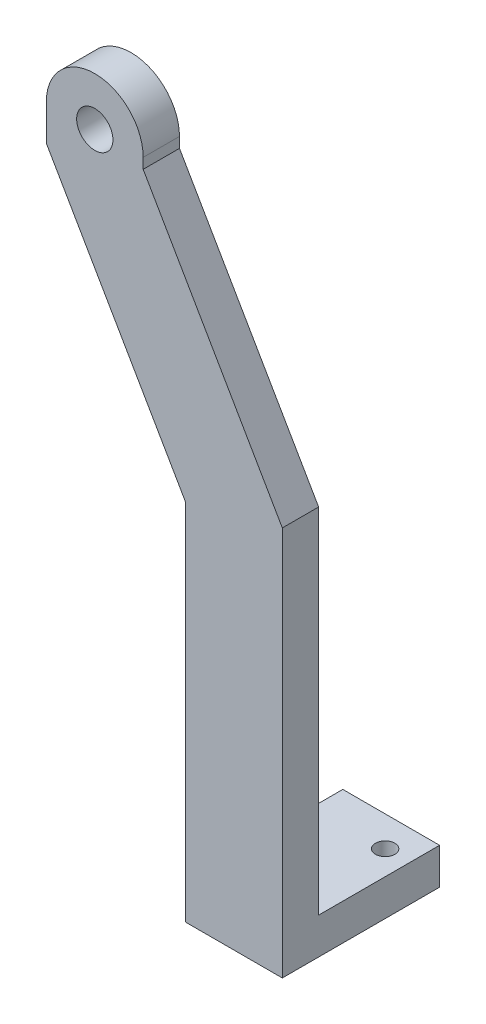
ISO-10303-21;
HEADER;
FILE_DESCRIPTION(('STEP AP214'),'2;1');
FILE_NAME('part.step','',(''),(''),'','','');
FILE_SCHEMA(('AUTOMOTIVE_DESIGN { 1 0 10303 214 1 1 1 1 }'));
ENDSEC;
DATA;
#1=APPLICATION_CONTEXT('core data for automotive mechanical design processes');
#2=APPLICATION_PROTOCOL_DEFINITION('international standard','automotive_design',2000,#1);
#3=PRODUCT_CONTEXT('',#1,'mechanical');
#4=PRODUCT('Part','Part','',(#3));
#5=PRODUCT_RELATED_PRODUCT_CATEGORY('part','',(#4));
#6=PRODUCT_DEFINITION_FORMATION('','',#4);
#7=PRODUCT_DEFINITION_CONTEXT('part definition',#1,'design');
#8=PRODUCT_DEFINITION('design','',#6,#7);
#9=PRODUCT_DEFINITION_SHAPE('','',#8);
#10=(LENGTH_UNIT() NAMED_UNIT(*) SI_UNIT(.MILLI.,.METRE.));
#11=(NAMED_UNIT(*) PLANE_ANGLE_UNIT() SI_UNIT($,.RADIAN.));
#12=(NAMED_UNIT(*) SI_UNIT($,.STERADIAN.) SOLID_ANGLE_UNIT());
#13=UNCERTAINTY_MEASURE_WITH_UNIT(LENGTH_MEASURE(1.E-05),#10,'distance_accuracy_value','');
#14=(GEOMETRIC_REPRESENTATION_CONTEXT(3) GLOBAL_UNCERTAINTY_ASSIGNED_CONTEXT((#13)) GLOBAL_UNIT_ASSIGNED_CONTEXT((#10,
#11,#12)) REPRESENTATION_CONTEXT('',''));
#15=CARTESIAN_POINT('',(0.,0.,0.));
#16=DIRECTION('',(0.,0.,1.));
#17=DIRECTION('',(1.,0.,0.));
#18=AXIS2_PLACEMENT_3D('',#15,#16,#17);
#19=CARTESIAN_POINT('',(34.,-14.,-8.));
#20=DIRECTION('',(0.,1.,0.));
#21=DIRECTION('',(-1.,0.,0.));
#22=AXIS2_PLACEMENT_3D('',#19,#20,#21);
#23=CYLINDRICAL_SURFACE('',#22,1.6);
#24=CARTESIAN_POINT('',(34.,0.,-8.));
#25=DIRECTION('',(0.,1.,0.));
#26=DIRECTION('',(-1.,0.,0.));
#27=AXIS2_PLACEMENT_3D('',#24,#25,#26);
#28=CIRCLE('',#27,1.6);
#29=CARTESIAN_POINT('',(32.4,0.,-8.));
#30=VERTEX_POINT('',#29);
#31=EDGE_CURVE('E154',#30,#30,#28,.F.);
#32=ORIENTED_EDGE('',*,*,#31,.T.);
#33=EDGE_LOOP('',(#32));
#34=FACE_BOUND('',#33,.T.);
#35=CARTESIAN_POINT('',(34.,5.99999999999999,-8.));
#36=DIRECTION('',(0.,1.,0.));
#37=DIRECTION('',(-1.,0.,0.));
#38=AXIS2_PLACEMENT_3D('',#35,#36,#37);
#39=CIRCLE('',#38,1.6);
#40=CARTESIAN_POINT('',(32.4,5.99999999999999,-8.));
#41=VERTEX_POINT('',#40);
#42=EDGE_CURVE('E20',#41,#41,#39,.T.);
#43=ORIENTED_EDGE('',*,*,#42,.T.);
#44=EDGE_LOOP('',(#43));
#45=FACE_BOUND('',#44,.T.);
#46=ADVANCED_FACE('F17',(#34,#45),#23,.F.);
#47=CARTESIAN_POINT('',(42.,-14.,-15.));
#48=DIRECTION('',(0.,1.,0.));
#49=DIRECTION('',(-1.,0.,0.));
#50=AXIS2_PLACEMENT_3D('',#47,#48,#49);
#51=CYLINDRICAL_SURFACE('',#50,1.6);
#52=CARTESIAN_POINT('',(42.,0.,-15.));
#53=DIRECTION('',(0.,1.,0.));
#54=DIRECTION('',(-1.,0.,0.));
#55=AXIS2_PLACEMENT_3D('',#52,#53,#54);
#56=CIRCLE('',#55,1.6);
#57=CARTESIAN_POINT('',(40.4,0.,-15.));
#58=VERTEX_POINT('',#57);
#59=EDGE_CURVE('E150',#58,#58,#56,.F.);
#60=ORIENTED_EDGE('',*,*,#59,.T.);
#61=EDGE_LOOP('',(#60));
#62=FACE_BOUND('',#61,.T.);
#63=CARTESIAN_POINT('',(42.,5.99999999999999,-15.));
#64=DIRECTION('',(0.,1.,0.));
#65=DIRECTION('',(-1.,0.,0.));
#66=AXIS2_PLACEMENT_3D('',#63,#64,#65);
#67=CIRCLE('',#66,1.6);
#68=CARTESIAN_POINT('',(40.4,5.99999999999999,-15.));
#69=VERTEX_POINT('',#68);
#70=EDGE_CURVE('E181',#69,#69,#67,.T.);
#71=ORIENTED_EDGE('',*,*,#70,.T.);
#72=EDGE_LOOP('',(#71));
#73=FACE_BOUND('',#72,.T.);
#74=ADVANCED_FACE('F221',(#62,#73),#51,.F.);
#75=CARTESIAN_POINT('',(46.,6.,-20.));
#76=DIRECTION('',(0.,-1.,0.));
#77=DIRECTION('',(1.,0.,0.));
#78=AXIS2_PLACEMENT_3D('',#75,#76,#77);
#79=PLANE('',#78);
#80=DIRECTION('',(0.,0.,1.));
#81=VECTOR('',#80,1.);
#82=CARTESIAN_POINT('',(46.,6.,6.));
#83=LINE('',#82,#81);
#84=CARTESIAN_POINT('',(46.,6.,0.));
#85=VERTEX_POINT('',#84);
#86=CARTESIAN_POINT('',(46.,6.,-20.));
#87=VERTEX_POINT('',#86);
#88=EDGE_CURVE('E142',#85,#87,#83,.F.);
#89=ORIENTED_EDGE('',*,*,#88,.T.);
#90=DIRECTION('',(1.,0.,0.));
#91=VECTOR('',#90,1.);
#92=CARTESIAN_POINT('',(0.,6.,-20.));
#93=LINE('',#92,#91);
#94=CARTESIAN_POINT('',(30.,6.,-20.));
#95=VERTEX_POINT('',#94);
#96=EDGE_CURVE('E179',#87,#95,#93,.F.);
#97=ORIENTED_EDGE('',*,*,#96,.T.);
#98=DIRECTION('',(0.,0.,1.));
#99=VECTOR('',#98,1.);
#100=CARTESIAN_POINT('',(30.,6.,6.));
#101=LINE('',#100,#99);
#102=CARTESIAN_POINT('',(30.,6.,0.));
#103=VERTEX_POINT('',#102);
#104=EDGE_CURVE('E155',#95,#103,#101,.T.);
#105=ORIENTED_EDGE('',*,*,#104,.T.);
#106=DIRECTION('',(1.,0.,0.));
#107=VECTOR('',#106,1.);
#108=CARTESIAN_POINT('',(15.,6.00000000000001,0.));
#109=LINE('',#108,#107);
#110=EDGE_CURVE('E174',#103,#85,#109,.T.);
#111=ORIENTED_EDGE('',*,*,#110,.T.);
#112=EDGE_LOOP('',(#89,#97,#105,#111));
#113=FACE_BOUND('',#112,.T.);
#114=ORIENTED_EDGE('',*,*,#70,.F.);
#115=EDGE_LOOP('',(#114));
#116=FACE_BOUND('',#115,.T.);
#117=ORIENTED_EDGE('',*,*,#42,.F.);
#118=EDGE_LOOP('',(#117));
#119=FACE_BOUND('',#118,.T.);
#120=ADVANCED_FACE('F218',(#113,#116,#119),#79,.F.);
#121=CARTESIAN_POINT('',(0.,0.,-20.));
#122=DIRECTION('',(0.,0.,1.));
#123=DIRECTION('',(1.,0.,0.));
#124=AXIS2_PLACEMENT_3D('',#121,#122,#123);
#125=PLANE('',#124);
#126=DIRECTION('',(1.,0.,0.));
#127=VECTOR('',#126,1.);
#128=CARTESIAN_POINT('',(30.,0.,-20.));
#129=LINE('',#128,#127);
#130=CARTESIAN_POINT('',(46.,0.,-20.));
#131=VERTEX_POINT('',#130);
#132=CARTESIAN_POINT('',(30.,0.,-20.));
#133=VERTEX_POINT('',#132);
#134=EDGE_CURVE('E111',#131,#133,#129,.F.);
#135=ORIENTED_EDGE('',*,*,#134,.T.);
#136=DIRECTION('',(0.,1.,0.));
#137=VECTOR('',#136,1.);
#138=CARTESIAN_POINT('',(30.,60.1435935394485,-20.));
#139=LINE('',#138,#137);
#140=EDGE_CURVE('E157',#133,#95,#139,.T.);
#141=ORIENTED_EDGE('',*,*,#140,.T.);
#142=ORIENTED_EDGE('',*,*,#96,.F.);
#143=DIRECTION('',(0.,-1.,0.));
#144=VECTOR('',#143,1.);
#145=CARTESIAN_POINT('',(46.,0.,-20.));
#146=LINE('',#145,#144);
#147=EDGE_CURVE('E115',#87,#131,#146,.T.);
#148=ORIENTED_EDGE('',*,*,#147,.T.);
#149=EDGE_LOOP('',(#135,#141,#142,#148));
#150=FACE_BOUND('',#149,.T.);
#151=ADVANCED_FACE('F220',(#150),#125,.F.);
#152=CARTESIAN_POINT('',(23.,104.267949192431,6.));
#153=DIRECTION('',(-1.,0.,0.));
#154=DIRECTION('',(0.,-1.,0.));
#155=AXIS2_PLACEMENT_3D('',#152,#153,#154);
#156=PLANE('',#155);
#157=DIRECTION('',(0.,0.,-1.));
#158=VECTOR('',#157,1.);
#159=CARTESIAN_POINT('',(23.,105.980762113533,6.));
#160=LINE('',#159,#158);
#161=CARTESIAN_POINT('',(23.,105.980762113533,6.));
#162=VERTEX_POINT('',#161);
#163=CARTESIAN_POINT('',(23.,105.980762113533,0.));
#164=VERTEX_POINT('',#163);
#165=EDGE_CURVE('E165',#162,#164,#160,.T.);
#166=ORIENTED_EDGE('',*,*,#165,.F.);
#167=DIRECTION('',(0.,-1.,0.));
#168=VECTOR('',#167,1.);
#169=CARTESIAN_POINT('',(23.,104.267949192431,6.));
#170=LINE('',#169,#168);
#171=CARTESIAN_POINT('',(23.,104.267949192431,6.));
#172=VERTEX_POINT('',#171);
#173=EDGE_CURVE('E35',#172,#162,#170,.F.);
#174=ORIENTED_EDGE('',*,*,#173,.F.);
#175=DIRECTION('',(0.,0.,1.));
#176=VECTOR('',#175,1.);
#177=CARTESIAN_POINT('',(23.,104.267949192431,6.));
#178=LINE('',#177,#176);
#179=CARTESIAN_POINT('',(23.,104.267949192431,0.));
#180=VERTEX_POINT('',#179);
#181=EDGE_CURVE('E139',#172,#180,#178,.F.);
#182=ORIENTED_EDGE('',*,*,#181,.T.);
#183=DIRECTION('',(0.,1.,0.));
#184=VECTOR('',#183,1.);
#185=CARTESIAN_POINT('',(23.,105.980762113533,0.));
#186=LINE('',#185,#184);
#187=EDGE_CURVE('E52',#180,#164,#186,.T.);
#188=ORIENTED_EDGE('',*,*,#187,.T.);
#189=EDGE_LOOP('',(#166,#174,#182,#188));
#190=FACE_BOUND('',#189,.T.);
#191=ADVANCED_FACE('F229',(#190),#156,.F.);
#192=CARTESIAN_POINT('',(15.,105.980762113533,0.));
#193=DIRECTION('',(0.,0.,1.));
#194=DIRECTION('',(1.,0.,0.));
#195=AXIS2_PLACEMENT_3D('',#192,#193,#194);
#196=PLANE('',#195);
#197=DIRECTION('',(0.,1.,0.));
#198=VECTOR('',#197,1.);
#199=CARTESIAN_POINT('',(30.,60.1435935394485,0.));
#200=LINE('',#199,#198);
#201=CARTESIAN_POINT('',(30.,60.1435935394485,0.));
#202=VERTEX_POINT('',#201);
#203=EDGE_CURVE('E151',#103,#202,#200,.T.);
#204=ORIENTED_EDGE('',*,*,#203,.T.);
#205=DIRECTION('',(-0.499999999999995,0.866025403784442,0.));
#206=VECTOR('',#205,1.);
#207=CARTESIAN_POINT('',(30.,60.1435935394485,0.));
#208=LINE('',#207,#206);
#209=CARTESIAN_POINT('',(7.00000000000002,99.9807621135331,0.));
#210=VERTEX_POINT('',#209);
#211=EDGE_CURVE('E162',#202,#210,#208,.T.);
#212=ORIENTED_EDGE('',*,*,#211,.T.);
#213=DIRECTION('',(0.,1.,0.));
#214=VECTOR('',#213,1.);
#215=CARTESIAN_POINT('',(7.00000000000003,105.980762113533,0.));
#216=LINE('',#215,#214);
#217=CARTESIAN_POINT('',(7.00000000000003,105.980762113533,0.));
#218=VERTEX_POINT('',#217);
#219=EDGE_CURVE('E65',#210,#218,#216,.T.);
#220=ORIENTED_EDGE('',*,*,#219,.T.);
#221=CARTESIAN_POINT('',(15.,105.980762113533,0.));
#222=DIRECTION('',(0.,0.,-1.));
#223=DIRECTION('',(-1.,0.,0.));
#224=AXIS2_PLACEMENT_3D('',#221,#222,#223);
#225=CIRCLE('',#224,8.);
#226=EDGE_CURVE('E58',#164,#218,#225,.F.);
#227=ORIENTED_EDGE('',*,*,#226,.F.);
#228=ORIENTED_EDGE('',*,*,#187,.F.);
#229=DIRECTION('',(0.499999999999995,-0.866025403784441,0.));
#230=VECTOR('',#229,1.);
#231=CARTESIAN_POINT('',(46.,64.4307806183464,0.));
#232=LINE('',#231,#230);
#233=CARTESIAN_POINT('',(46.,64.4307806183464,0.));
#234=VERTEX_POINT('',#233);
#235=EDGE_CURVE('E192',#180,#234,#232,.T.);
#236=ORIENTED_EDGE('',*,*,#235,.T.);
#237=DIRECTION('',(0.,-1.,0.));
#238=VECTOR('',#237,1.);
#239=CARTESIAN_POINT('',(46.,0.,0.));
#240=LINE('',#239,#238);
#241=EDGE_CURVE('E144',#234,#85,#240,.T.);
#242=ORIENTED_EDGE('',*,*,#241,.T.);
#243=ORIENTED_EDGE('',*,*,#110,.F.);
#244=EDGE_LOOP('',(#204,#212,#220,#227,#228,#236,#242,#243));
#245=FACE_BOUND('',#244,.T.);
#246=CARTESIAN_POINT('',(15.,105.980762113533,0.));
#247=DIRECTION('',(0.,0.,-1.));
#248=DIRECTION('',(-1.,0.,0.));
#249=AXIS2_PLACEMENT_3D('',#246,#247,#248);
#250=CIRCLE('',#249,3.00000000000001);
#251=CARTESIAN_POINT('',(12.,105.980762113533,0.));
#252=VERTEX_POINT('',#251);
#253=EDGE_CURVE('E197',#252,#252,#250,.F.);
#254=ORIENTED_EDGE('',*,*,#253,.T.);
#255=EDGE_LOOP('',(#254));
#256=FACE_BOUND('',#255,.T.);
#257=ADVANCED_FACE('F266',(#245,#256),#196,.F.);
#258=CARTESIAN_POINT('',(15.,105.980762113533,6.));
#259=DIRECTION('',(0.,0.,-1.));
#260=DIRECTION('',(-1.,0.,0.));
#261=AXIS2_PLACEMENT_3D('',#258,#259,#260);
#262=CYLINDRICAL_SURFACE('',#261,8.);
#263=CARTESIAN_POINT('',(15.,105.980762113533,6.));
#264=DIRECTION('',(0.,0.,-1.));
#265=DIRECTION('',(-1.,0.,0.));
#266=AXIS2_PLACEMENT_3D('',#263,#264,#265);
#267=CIRCLE('',#266,8.);
#268=CARTESIAN_POINT('',(7.00000000000003,105.980762113533,6.));
#269=VERTEX_POINT('',#268);
#270=EDGE_CURVE('E136',#162,#269,#267,.F.);
#271=ORIENTED_EDGE('',*,*,#270,.F.);
#272=ORIENTED_EDGE('',*,*,#165,.T.);
#273=ORIENTED_EDGE('',*,*,#226,.T.);
#274=DIRECTION('',(0.,0.,-1.));
#275=VECTOR('',#274,1.);
#276=CARTESIAN_POINT('',(7.00000000000003,105.980762113533,6.));
#277=LINE('',#276,#275);
#278=EDGE_CURVE('E163',#218,#269,#277,.F.);
#279=ORIENTED_EDGE('',*,*,#278,.T.);
#280=EDGE_LOOP('',(#271,#272,#273,#279));
#281=FACE_BOUND('',#280,.T.);
#282=ADVANCED_FACE('F263',(#281),#262,.T.);
#283=CARTESIAN_POINT('',(7.00000000000003,105.980762113533,6.));
#284=DIRECTION('',(1.,0.,0.));
#285=DIRECTION('',(0.,0.,-1.));
#286=AXIS2_PLACEMENT_3D('',#283,#284,#285);
#287=PLANE('',#286);
#288=DIRECTION('',(0.,0.,1.));
#289=VECTOR('',#288,1.);
#290=CARTESIAN_POINT('',(7.00000000000002,99.9807621135331,6.));
#291=LINE('',#290,#289);
#292=CARTESIAN_POINT('',(7.00000000000003,99.9807621135331,6.));
#293=VERTEX_POINT('',#292);
#294=EDGE_CURVE('E169',#210,#293,#291,.T.);
#295=ORIENTED_EDGE('',*,*,#294,.T.);
#296=DIRECTION('',(0.,1.,0.));
#297=VECTOR('',#296,1.);
#298=CARTESIAN_POINT('',(7.00000000000003,105.980762113533,6.));
#299=LINE('',#298,#297);
#300=EDGE_CURVE('E133',#269,#293,#299,.F.);
#301=ORIENTED_EDGE('',*,*,#300,.F.);
#302=ORIENTED_EDGE('',*,*,#278,.F.);
#303=ORIENTED_EDGE('',*,*,#219,.F.);
#304=EDGE_LOOP('',(#295,#301,#302,#303));
#305=FACE_BOUND('',#304,.T.);
#306=ADVANCED_FACE('F259',(#305),#287,.F.);
#307=CARTESIAN_POINT('',(30.,60.1435935394485,6.));
#308=DIRECTION('',(0.866025403784442,0.499999999999995,0.));
#309=DIRECTION('',(-0.499999999999995,0.866025403784442,0.));
#310=AXIS2_PLACEMENT_3D('',#307,#308,#309);
#311=PLANE('',#310);
#312=DIRECTION('',(0.,0.,1.));
#313=VECTOR('',#312,1.);
#314=CARTESIAN_POINT('',(30.,60.1435935394485,6.));
#315=LINE('',#314,#313);
#316=CARTESIAN_POINT('',(30.,60.1435935394485,6.));
#317=VERTEX_POINT('',#316);
#318=EDGE_CURVE('E160',#202,#317,#315,.T.);
#319=ORIENTED_EDGE('',*,*,#318,.T.);
#320=DIRECTION('',(0.499999999999995,-0.866025403784441,0.));
#321=VECTOR('',#320,1.);
#322=CARTESIAN_POINT('',(7.00000000000003,99.9807621135331,6.));
#323=LINE('',#322,#321);
#324=EDGE_CURVE('E130',#293,#317,#323,.T.);
#325=ORIENTED_EDGE('',*,*,#324,.F.);
#326=ORIENTED_EDGE('',*,*,#294,.F.);
#327=ORIENTED_EDGE('',*,*,#211,.F.);
#328=EDGE_LOOP('',(#319,#325,#326,#327));
#329=FACE_BOUND('',#328,.T.);
#330=ADVANCED_FACE('F255',(#329),#311,.F.);
#331=CARTESIAN_POINT('',(30.,60.1435935394485,6.));
#332=DIRECTION('',(1.,0.,0.));
#333=DIRECTION('',(0.,1.,0.));
#334=AXIS2_PLACEMENT_3D('',#331,#332,#333);
#335=PLANE('',#334);
#336=ORIENTED_EDGE('',*,*,#104,.F.);
#337=ORIENTED_EDGE('',*,*,#140,.F.);
#338=DIRECTION('',(0.,0.,1.));
#339=VECTOR('',#338,1.);
#340=CARTESIAN_POINT('',(30.,0.,6.));
#341=LINE('',#340,#339);
#342=CARTESIAN_POINT('',(30.,0.,6.));
#343=VERTEX_POINT('',#342);
#344=EDGE_CURVE('E147',#133,#343,#341,.T.);
#345=ORIENTED_EDGE('',*,*,#344,.T.);
#346=DIRECTION('',(0.,1.,0.));
#347=VECTOR('',#346,1.);
#348=CARTESIAN_POINT('',(30.,105.980762113533,6.));
#349=LINE('',#348,#347);
#350=EDGE_CURVE('E128',#317,#343,#349,.F.);
#351=ORIENTED_EDGE('',*,*,#350,.F.);
#352=ORIENTED_EDGE('',*,*,#318,.F.);
#353=ORIENTED_EDGE('',*,*,#203,.F.);
#354=EDGE_LOOP('',(#336,#337,#345,#351,#352,#353));
#355=FACE_BOUND('',#354,.T.);
#356=ADVANCED_FACE('F252',(#355),#335,.F.);
#357=CARTESIAN_POINT('',(30.,0.,6.));
#358=DIRECTION('',(0.,1.,0.));
#359=DIRECTION('',(0.,0.,1.));
#360=AXIS2_PLACEMENT_3D('',#357,#358,#359);
#361=PLANE('',#360);
#362=ORIENTED_EDGE('',*,*,#134,.F.);
#363=DIRECTION('',(0.,0.,1.));
#364=VECTOR('',#363,1.);
#365=CARTESIAN_POINT('',(46.,0.,6.));
#366=LINE('',#365,#364);
#367=CARTESIAN_POINT('',(46.,0.,6.));
#368=VERTEX_POINT('',#367);
#369=EDGE_CURVE('E103',#131,#368,#366,.T.);
#370=ORIENTED_EDGE('',*,*,#369,.T.);
#371=DIRECTION('',(1.,0.,0.));
#372=VECTOR('',#371,1.);
#373=CARTESIAN_POINT('',(15.,0.,6.));
#374=LINE('',#373,#372);
#375=EDGE_CURVE('E109',#343,#368,#374,.T.);
#376=ORIENTED_EDGE('',*,*,#375,.F.);
#377=ORIENTED_EDGE('',*,*,#344,.F.);
#378=EDGE_LOOP('',(#362,#370,#376,#377));
#379=FACE_BOUND('',#378,.T.);
#380=ORIENTED_EDGE('',*,*,#59,.F.);
#381=EDGE_LOOP('',(#380));
#382=FACE_BOUND('',#381,.T.);
#383=ORIENTED_EDGE('',*,*,#31,.F.);
#384=EDGE_LOOP('',(#383));
#385=FACE_BOUND('',#384,.T.);
#386=ADVANCED_FACE('F105',(#379,#382,#385),#361,.F.);
#387=CARTESIAN_POINT('',(46.,0.,6.));
#388=DIRECTION('',(-1.,0.,0.));
#389=DIRECTION('',(0.,-1.,0.));
#390=AXIS2_PLACEMENT_3D('',#387,#388,#389);
#391=PLANE('',#390);
#392=ORIENTED_EDGE('',*,*,#147,.F.);
#393=ORIENTED_EDGE('',*,*,#88,.F.);
#394=ORIENTED_EDGE('',*,*,#241,.F.);
#395=DIRECTION('',(0.,0.,1.));
#396=VECTOR('',#395,1.);
#397=CARTESIAN_POINT('',(46.,64.4307806183464,6.));
#398=LINE('',#397,#396);
#399=CARTESIAN_POINT('',(46.,64.4307806183464,6.));
#400=VERTEX_POINT('',#399);
#401=EDGE_CURVE('E114',#234,#400,#398,.T.);
#402=ORIENTED_EDGE('',*,*,#401,.T.);
#403=DIRECTION('',(0.,1.,0.));
#404=VECTOR('',#403,1.);
#405=CARTESIAN_POINT('',(46.,105.980762113533,6.));
#406=LINE('',#405,#404);
#407=EDGE_CURVE('E118',#368,#400,#406,.T.);
#408=ORIENTED_EDGE('',*,*,#407,.F.);
#409=ORIENTED_EDGE('',*,*,#369,.F.);
#410=EDGE_LOOP('',(#392,#393,#394,#402,#408,#409));
#411=FACE_BOUND('',#410,.T.);
#412=ADVANCED_FACE('F119',(#411),#391,.F.);
#413=CARTESIAN_POINT('',(46.,64.4307806183464,6.));
#414=DIRECTION('',(-0.866025403784441,-0.499999999999995,0.));
#415=DIRECTION('',(0.499999999999995,-0.866025403784441,0.));
#416=AXIS2_PLACEMENT_3D('',#413,#414,#415);
#417=PLANE('',#416);
#418=ORIENTED_EDGE('',*,*,#181,.F.);
#419=DIRECTION('',(-0.499999999999995,0.866025403784441,0.));
#420=VECTOR('',#419,1.);
#421=CARTESIAN_POINT('',(46.,64.4307806183464,6.));
#422=LINE('',#421,#420);
#423=EDGE_CURVE('E26',#400,#172,#422,.T.);
#424=ORIENTED_EDGE('',*,*,#423,.F.);
#425=ORIENTED_EDGE('',*,*,#401,.F.);
#426=ORIENTED_EDGE('',*,*,#235,.F.);
#427=EDGE_LOOP('',(#418,#424,#425,#426));
#428=FACE_BOUND('',#427,.T.);
#429=ADVANCED_FACE('F241',(#428),#417,.F.);
#430=CARTESIAN_POINT('',(15.,105.980762113533,6.));
#431=DIRECTION('',(0.,0.,-1.));
#432=DIRECTION('',(-1.,0.,0.));
#433=AXIS2_PLACEMENT_3D('',#430,#431,#432);
#434=CYLINDRICAL_SURFACE('',#433,3.00000000000001);
#435=CARTESIAN_POINT('',(15.,105.980762113533,6.));
#436=DIRECTION('',(0.,0.,-1.));
#437=DIRECTION('',(-1.,0.,0.));
#438=AXIS2_PLACEMENT_3D('',#435,#436,#437);
#439=CIRCLE('',#438,3.00000000000001);
#440=CARTESIAN_POINT('',(12.,105.980762113533,6.));
#441=VERTEX_POINT('',#440);
#442=EDGE_CURVE('E11',#441,#441,#439,.T.);
#443=ORIENTED_EDGE('',*,*,#442,.F.);
#444=EDGE_LOOP('',(#443));
#445=FACE_BOUND('',#444,.T.);
#446=ORIENTED_EDGE('',*,*,#253,.F.);
#447=EDGE_LOOP('',(#446));
#448=FACE_BOUND('',#447,.T.);
#449=ADVANCED_FACE('F235',(#445,#448),#434,.F.);
#450=CARTESIAN_POINT('',(15.,105.980762113533,6.));
#451=DIRECTION('',(0.,0.,1.));
#452=DIRECTION('',(1.,0.,0.));
#453=AXIS2_PLACEMENT_3D('',#450,#451,#452);
#454=PLANE('',#453);
#455=ORIENTED_EDGE('',*,*,#442,.T.);
#456=EDGE_LOOP('',(#455));
#457=FACE_BOUND('',#456,.T.);
#458=ORIENTED_EDGE('',*,*,#423,.T.);
#459=ORIENTED_EDGE('',*,*,#173,.T.);
#460=ORIENTED_EDGE('',*,*,#270,.T.);
#461=ORIENTED_EDGE('',*,*,#300,.T.);
#462=ORIENTED_EDGE('',*,*,#324,.T.);
#463=ORIENTED_EDGE('',*,*,#350,.T.);
#464=ORIENTED_EDGE('',*,*,#375,.T.);
#465=ORIENTED_EDGE('',*,*,#407,.T.);
#466=EDGE_LOOP('',(#458,#459,#460,#461,#462,#463,#464,#465));
#467=FACE_BOUND('',#466,.T.);
#468=ADVANCED_FACE('F125',(#457,#467),#454,.T.);
#469=CLOSED_SHELL('',(#46,#74,#120,#151,#191,#257,#282,#306,#330,#356,#386,#412,#429,#449,#468));
#470=MANIFOLD_SOLID_BREP('B1',#469);
#471=ADVANCED_BREP_SHAPE_REPRESENTATION('',(#18,#470),#14);
#472=SHAPE_DEFINITION_REPRESENTATION(#9,#471);
ENDSEC;
END-ISO-10303-21;
